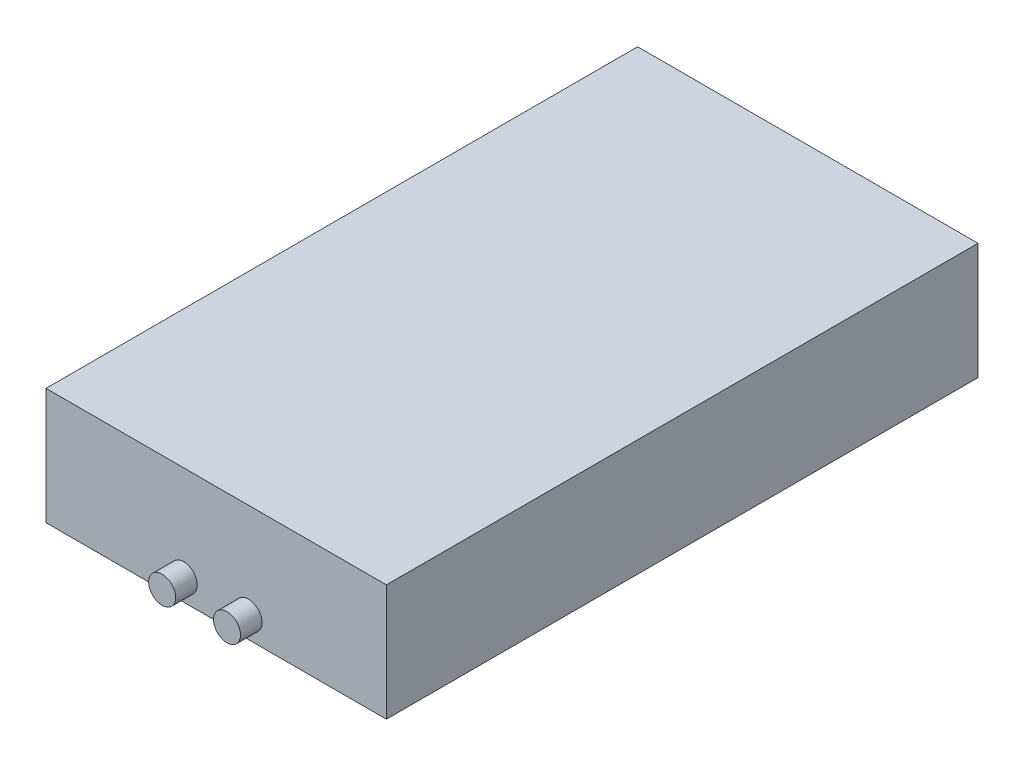
ISO-10303-21;
HEADER;
FILE_DESCRIPTION(('STEP AP214'),'2;1');
FILE_NAME('part.step','',(''),(''),'','','');
FILE_SCHEMA(('AUTOMOTIVE_DESIGN { 1 0 10303 214 1 1 1 1 }'));
ENDSEC;
DATA;
#1=APPLICATION_CONTEXT('core data for automotive mechanical design processes');
#2=APPLICATION_PROTOCOL_DEFINITION('international standard','automotive_design',2000,#1);
#3=PRODUCT_CONTEXT('',#1,'mechanical');
#4=PRODUCT('Part','Part','',(#3));
#5=PRODUCT_RELATED_PRODUCT_CATEGORY('part','',(#4));
#6=PRODUCT_DEFINITION_FORMATION('','',#4);
#7=PRODUCT_DEFINITION_CONTEXT('part definition',#1,'design');
#8=PRODUCT_DEFINITION('design','',#6,#7);
#9=PRODUCT_DEFINITION_SHAPE('','',#8);
#10=(LENGTH_UNIT() NAMED_UNIT(*) SI_UNIT(.MILLI.,.METRE.));
#11=(NAMED_UNIT(*) PLANE_ANGLE_UNIT() SI_UNIT($,.RADIAN.));
#12=(NAMED_UNIT(*) SI_UNIT($,.STERADIAN.) SOLID_ANGLE_UNIT());
#13=UNCERTAINTY_MEASURE_WITH_UNIT(LENGTH_MEASURE(1.E-05),#10,'distance_accuracy_value','');
#14=(GEOMETRIC_REPRESENTATION_CONTEXT(3) GLOBAL_UNCERTAINTY_ASSIGNED_CONTEXT((#13)) GLOBAL_UNIT_ASSIGNED_CONTEXT((#10,
#11,#12)) REPRESENTATION_CONTEXT('',''));
#15=CARTESIAN_POINT('',(0.,0.,0.));
#16=DIRECTION('',(0.,0.,1.));
#17=DIRECTION('',(1.,0.,0.));
#18=AXIS2_PLACEMENT_3D('',#15,#16,#17);
#19=CARTESIAN_POINT('',(-31.5,10.77,109.5));
#20=DIRECTION('',(1.,0.,0.));
#21=DIRECTION('',(0.,0.,-1.));
#22=AXIS2_PLACEMENT_3D('',#19,#20,#21);
#23=PLANE('',#22);
#24=DIRECTION('',(0.,-1.,0.));
#25=VECTOR('',#24,1.);
#26=CARTESIAN_POINT('',(-31.5,10.77,0.));
#27=LINE('',#26,#25);
#28=CARTESIAN_POINT('',(-31.5,10.77,0.));
#29=VERTEX_POINT('',#28);
#30=CARTESIAN_POINT('',(-31.5,-10.77,0.));
#31=VERTEX_POINT('',#30);
#32=EDGE_CURVE('E134',#29,#31,#27,.T.);
#33=ORIENTED_EDGE('',*,*,#32,.T.);
#34=DIRECTION('',(0.,0.,-1.));
#35=VECTOR('',#34,1.);
#36=CARTESIAN_POINT('',(-31.5,-10.77,109.5));
#37=LINE('',#36,#35);
#38=CARTESIAN_POINT('',(-31.5,-10.77,109.5));
#39=VERTEX_POINT('',#38);
#40=EDGE_CURVE('E11',#39,#31,#37,.T.);
#41=ORIENTED_EDGE('',*,*,#40,.F.);
#42=DIRECTION('',(0.,-1.,0.));
#43=VECTOR('',#42,1.);
#44=CARTESIAN_POINT('',(-31.5,10.77,109.5));
#45=LINE('',#44,#43);
#46=CARTESIAN_POINT('',(-31.5,10.77,109.5));
#47=VERTEX_POINT('',#46);
#48=EDGE_CURVE('E135',#47,#39,#45,.T.);
#49=ORIENTED_EDGE('',*,*,#48,.F.);
#50=DIRECTION('',(0.,0.,-1.));
#51=VECTOR('',#50,1.);
#52=CARTESIAN_POINT('',(-31.5,10.77,109.5));
#53=LINE('',#52,#51);
#54=EDGE_CURVE('E141',#47,#29,#53,.T.);
#55=ORIENTED_EDGE('',*,*,#54,.T.);
#56=EDGE_LOOP('',(#33,#41,#49,#55));
#57=FACE_BOUND('',#56,.T.);
#58=ADVANCED_FACE('F39',(#57),#23,.F.);
#59=CARTESIAN_POINT('',(-31.5,-10.77,109.5));
#60=DIRECTION('',(0.,1.,0.));
#61=DIRECTION('',(0.,0.,1.));
#62=AXIS2_PLACEMENT_3D('',#59,#60,#61);
#63=PLANE('',#62);
#64=CARTESIAN_POINT('',(-7.00000000000001,-10.77,105.2));
#65=DIRECTION('',(0.,-1.,0.));
#66=DIRECTION('',(0.,0.,-1.));
#67=AXIS2_PLACEMENT_3D('',#64,#65,#66);
#68=CIRCLE('',#67,0.799999999999999);
#69=CARTESIAN_POINT('',(-7.00000000000001,-10.77,104.4));
#70=VERTEX_POINT('',#69);
#71=EDGE_CURVE('E110',#70,#70,#68,.T.);
#72=ORIENTED_EDGE('',*,*,#71,.F.);
#73=EDGE_LOOP('',(#72));
#74=FACE_BOUND('',#73,.T.);
#75=CARTESIAN_POINT('',(6.99999999999999,-10.77,105.2));
#76=DIRECTION('',(0.,-1.,0.));
#77=DIRECTION('',(0.,0.,-1.));
#78=AXIS2_PLACEMENT_3D('',#75,#76,#77);
#79=CIRCLE('',#78,0.799999999999999);
#80=CARTESIAN_POINT('',(6.99999999999999,-10.77,104.4));
#81=VERTEX_POINT('',#80);
#82=EDGE_CURVE('E109',#81,#81,#79,.T.);
#83=ORIENTED_EDGE('',*,*,#82,.F.);
#84=EDGE_LOOP('',(#83));
#85=FACE_BOUND('',#84,.T.);
#86=CARTESIAN_POINT('',(22.3097569986762,-10.77,30.7625219081238));
#87=DIRECTION('',(0.,-1.,0.));
#88=DIRECTION('',(0.,0.,-1.));
#89=AXIS2_PLACEMENT_3D('',#86,#87,#88);
#90=CIRCLE('',#89,0.799999999999999);
#91=CARTESIAN_POINT('',(22.3097569986762,-10.77,29.9625219081238));
#92=VERTEX_POINT('',#91);
#93=EDGE_CURVE('E122',#92,#92,#90,.T.);
#94=ORIENTED_EDGE('',*,*,#93,.F.);
#95=EDGE_LOOP('',(#94));
#96=FACE_BOUND('',#95,.T.);
#97=CARTESIAN_POINT('',(-22.3097569986762,-10.77,30.7625219081238));
#98=DIRECTION('',(0.,-1.,0.));
#99=DIRECTION('',(0.,0.,-1.));
#100=AXIS2_PLACEMENT_3D('',#97,#98,#99);
#101=CIRCLE('',#100,0.799999999999999);
#102=CARTESIAN_POINT('',(-22.3097569986762,-10.77,29.9625219081238));
#103=VERTEX_POINT('',#102);
#104=EDGE_CURVE('E128',#103,#103,#101,.T.);
#105=ORIENTED_EDGE('',*,*,#104,.F.);
#106=EDGE_LOOP('',(#105));
#107=FACE_BOUND('',#106,.T.);
#108=DIRECTION('',(1.,0.,0.));
#109=VECTOR('',#108,1.);
#110=CARTESIAN_POINT('',(-31.5,-10.77,0.));
#111=LINE('',#110,#109);
#112=CARTESIAN_POINT('',(31.5,-10.77,0.));
#113=VERTEX_POINT('',#112);
#114=EDGE_CURVE('E144',#31,#113,#111,.T.);
#115=ORIENTED_EDGE('',*,*,#114,.T.);
#116=DIRECTION('',(0.,0.,-1.));
#117=VECTOR('',#116,1.);
#118=CARTESIAN_POINT('',(31.5,-10.77,109.5));
#119=LINE('',#118,#117);
#120=CARTESIAN_POINT('',(31.5,-10.77,109.5));
#121=VERTEX_POINT('',#120);
#122=EDGE_CURVE('E47',#121,#113,#119,.T.);
#123=ORIENTED_EDGE('',*,*,#122,.F.);
#124=DIRECTION('',(1.,0.,0.));
#125=VECTOR('',#124,1.);
#126=CARTESIAN_POINT('',(-31.5,-10.77,109.5));
#127=LINE('',#126,#125);
#128=EDGE_CURVE('E86',#39,#121,#127,.T.);
#129=ORIENTED_EDGE('',*,*,#128,.F.);
#130=ORIENTED_EDGE('',*,*,#40,.T.);
#131=EDGE_LOOP('',(#115,#123,#129,#130));
#132=FACE_BOUND('',#131,.T.);
#133=ADVANCED_FACE('F168',(#74,#85,#96,#107,#132),#63,.F.);
#134=CARTESIAN_POINT('',(31.5,10.77,109.5));
#135=DIRECTION('',(-1.,0.,0.));
#136=DIRECTION('',(0.,-1.,0.));
#137=AXIS2_PLACEMENT_3D('',#134,#135,#136);
#138=PLANE('',#137);
#139=DIRECTION('',(0.,1.,0.));
#140=VECTOR('',#139,1.);
#141=CARTESIAN_POINT('',(31.5,10.77,0.));
#142=LINE('',#141,#140);
#143=CARTESIAN_POINT('',(31.5,10.77,0.));
#144=VERTEX_POINT('',#143);
#145=EDGE_CURVE('E73',#113,#144,#142,.T.);
#146=ORIENTED_EDGE('',*,*,#145,.T.);
#147=DIRECTION('',(0.,0.,-1.));
#148=VECTOR('',#147,1.);
#149=CARTESIAN_POINT('',(31.5,10.77,109.5));
#150=LINE('',#149,#148);
#151=CARTESIAN_POINT('',(31.5,10.77,109.5));
#152=VERTEX_POINT('',#151);
#153=EDGE_CURVE('E149',#152,#144,#150,.T.);
#154=ORIENTED_EDGE('',*,*,#153,.F.);
#155=DIRECTION('',(0.,1.,0.));
#156=VECTOR('',#155,1.);
#157=CARTESIAN_POINT('',(31.5,10.77,109.5));
#158=LINE('',#157,#156);
#159=EDGE_CURVE('E138',#121,#152,#158,.T.);
#160=ORIENTED_EDGE('',*,*,#159,.F.);
#161=ORIENTED_EDGE('',*,*,#122,.T.);
#162=EDGE_LOOP('',(#146,#154,#160,#161));
#163=FACE_BOUND('',#162,.T.);
#164=ADVANCED_FACE('F151',(#163),#138,.F.);
#165=CARTESIAN_POINT('',(-31.5,10.77,109.5));
#166=DIRECTION('',(0.,-1.,0.));
#167=DIRECTION('',(0.,0.,-1.));
#168=AXIS2_PLACEMENT_3D('',#165,#166,#167);
#169=PLANE('',#168);
#170=DIRECTION('',(-1.,0.,0.));
#171=VECTOR('',#170,1.);
#172=CARTESIAN_POINT('',(-31.5,10.77,0.));
#173=LINE('',#172,#171);
#174=EDGE_CURVE('E79',#144,#29,#173,.T.);
#175=ORIENTED_EDGE('',*,*,#174,.T.);
#176=ORIENTED_EDGE('',*,*,#54,.F.);
#177=DIRECTION('',(-1.,0.,0.));
#178=VECTOR('',#177,1.);
#179=CARTESIAN_POINT('',(-31.5,10.77,109.5));
#180=LINE('',#179,#178);
#181=EDGE_CURVE('E55',#152,#47,#180,.T.);
#182=ORIENTED_EDGE('',*,*,#181,.F.);
#183=ORIENTED_EDGE('',*,*,#153,.T.);
#184=EDGE_LOOP('',(#175,#176,#182,#183));
#185=FACE_BOUND('',#184,.T.);
#186=ADVANCED_FACE('F158',(#185),#169,.F.);
#187=CARTESIAN_POINT('',(0.,0.,109.5));
#188=DIRECTION('',(0.,0.,1.));
#189=DIRECTION('',(1.,0.,0.));
#190=AXIS2_PLACEMENT_3D('',#187,#188,#189);
#191=PLANE('',#190);
#192=CARTESIAN_POINT('',(6.,-6.77,109.5));
#193=DIRECTION('',(0.,0.,1.));
#194=DIRECTION('',(-1.,0.,0.));
#195=AXIS2_PLACEMENT_3D('',#192,#193,#194);
#196=CIRCLE('',#195,2.5);
#197=CARTESIAN_POINT('',(3.5,-6.77,109.5));
#198=VERTEX_POINT('',#197);
#199=EDGE_CURVE('E231',#198,#198,#196,.T.);
#200=ORIENTED_EDGE('',*,*,#199,.F.);
#201=EDGE_LOOP('',(#200));
#202=FACE_BOUND('',#201,.T.);
#203=CARTESIAN_POINT('',(-6.,-6.77,109.5));
#204=DIRECTION('',(0.,0.,1.));
#205=DIRECTION('',(1.,0.,0.));
#206=AXIS2_PLACEMENT_3D('',#203,#204,#205);
#207=CIRCLE('',#206,2.5);
#208=CARTESIAN_POINT('',(-3.5,-6.77,109.5));
#209=VERTEX_POINT('',#208);
#210=EDGE_CURVE('E237',#209,#209,#207,.T.);
#211=ORIENTED_EDGE('',*,*,#210,.F.);
#212=EDGE_LOOP('',(#211));
#213=FACE_BOUND('',#212,.T.);
#214=ORIENTED_EDGE('',*,*,#48,.T.);
#215=ORIENTED_EDGE('',*,*,#128,.T.);
#216=ORIENTED_EDGE('',*,*,#159,.T.);
#217=ORIENTED_EDGE('',*,*,#181,.T.);
#218=EDGE_LOOP('',(#214,#215,#216,#217));
#219=FACE_BOUND('',#218,.T.);
#220=ADVANCED_FACE('F160',(#202,#213,#219),#191,.T.);
#221=CARTESIAN_POINT('',(0.,0.,0.));
#222=DIRECTION('',(0.,0.,1.));
#223=DIRECTION('',(1.,0.,0.));
#224=AXIS2_PLACEMENT_3D('',#221,#222,#223);
#225=PLANE('',#224);
#226=CARTESIAN_POINT('',(0.,0.,0.));
#227=DIRECTION('',(0.,0.,-1.));
#228=DIRECTION('',(-1.,0.,0.));
#229=AXIS2_PLACEMENT_3D('',#226,#227,#228);
#230=CIRCLE('',#229,7.41430232056074);
#231=CARTESIAN_POINT('',(-7.41430232056074,0.,0.));
#232=VERTEX_POINT('',#231);
#233=EDGE_CURVE('E225',#232,#232,#230,.T.);
#234=ORIENTED_EDGE('',*,*,#233,.F.);
#235=EDGE_LOOP('',(#234));
#236=FACE_BOUND('',#235,.T.);
#237=ORIENTED_EDGE('',*,*,#32,.F.);
#238=ORIENTED_EDGE('',*,*,#174,.F.);
#239=ORIENTED_EDGE('',*,*,#145,.F.);
#240=ORIENTED_EDGE('',*,*,#114,.F.);
#241=EDGE_LOOP('',(#237,#238,#239,#240));
#242=FACE_BOUND('',#241,.T.);
#243=ADVANCED_FACE('F154',(#236,#242),#225,.F.);
#244=CARTESIAN_POINT('',(-22.3097569986762,-5.57,30.7625219081238));
#245=DIRECTION('',(0.,-1.,0.));
#246=DIRECTION('',(0.,0.,-1.));
#247=AXIS2_PLACEMENT_3D('',#244,#245,#246);
#248=CONICAL_SURFACE('',#247,0.799999999999999,1.02974425867665);
#249=CARTESIAN_POINT('',(-22.3097569986762,-5.08931150477795,30.7625219081238));
#250=VERTEX_POINT('',#249);
#251=VERTEX_LOOP('',#250);
#252=FACE_BOUND('',#251,.T.);
#253=CARTESIAN_POINT('',(-22.3097569986762,-5.57,30.7625219081238));
#254=DIRECTION('',(0.,-1.,0.));
#255=DIRECTION('',(0.,0.,-1.));
#256=AXIS2_PLACEMENT_3D('',#253,#254,#255);
#257=CIRCLE('',#256,0.799999999999999);
#258=CARTESIAN_POINT('',(-22.3097569986762,-5.57,29.9625219081238));
#259=VERTEX_POINT('',#258);
#260=EDGE_CURVE('E131',#259,#259,#257,.T.);
#261=ORIENTED_EDGE('',*,*,#260,.T.);
#262=EDGE_LOOP('',(#261));
#263=FACE_BOUND('',#262,.T.);
#264=ADVANCED_FACE('F189',(#252,#263),#248,.F.);
#265=CARTESIAN_POINT('',(-22.3097569986762,-10.77,30.7625219081238));
#266=DIRECTION('',(0.,-1.,0.));
#267=DIRECTION('',(0.,0.,-1.));
#268=AXIS2_PLACEMENT_3D('',#265,#266,#267);
#269=CYLINDRICAL_SURFACE('',#268,0.799999999999999);
#270=ORIENTED_EDGE('',*,*,#260,.F.);
#271=EDGE_LOOP('',(#270));
#272=FACE_BOUND('',#271,.T.);
#273=ORIENTED_EDGE('',*,*,#104,.T.);
#274=EDGE_LOOP('',(#273));
#275=FACE_BOUND('',#274,.T.);
#276=ADVANCED_FACE('F186',(#272,#275),#269,.F.);
#277=CARTESIAN_POINT('',(22.3097569986762,-5.57,30.7625219081238));
#278=DIRECTION('',(0.,-1.,0.));
#279=DIRECTION('',(0.,0.,-1.));
#280=AXIS2_PLACEMENT_3D('',#277,#278,#279);
#281=CONICAL_SURFACE('',#280,0.799999999999999,1.02974425867665);
#282=CARTESIAN_POINT('',(22.3097569986762,-5.08931150477795,30.7625219081238));
#283=VERTEX_POINT('',#282);
#284=VERTEX_LOOP('',#283);
#285=FACE_BOUND('',#284,.T.);
#286=CARTESIAN_POINT('',(22.3097569986762,-5.57,30.7625219081238));
#287=DIRECTION('',(0.,-1.,0.));
#288=DIRECTION('',(0.,0.,-1.));
#289=AXIS2_PLACEMENT_3D('',#286,#287,#288);
#290=CIRCLE('',#289,0.799999999999999);
#291=CARTESIAN_POINT('',(22.3097569986762,-5.57,29.9625219081238));
#292=VERTEX_POINT('',#291);
#293=EDGE_CURVE('E125',#292,#292,#290,.T.);
#294=ORIENTED_EDGE('',*,*,#293,.T.);
#295=EDGE_LOOP('',(#294));
#296=FACE_BOUND('',#295,.T.);
#297=ADVANCED_FACE('F188',(#285,#296),#281,.F.);
#298=CARTESIAN_POINT('',(22.3097569986762,-10.77,30.7625219081238));
#299=DIRECTION('',(0.,-1.,0.));
#300=DIRECTION('',(0.,0.,-1.));
#301=AXIS2_PLACEMENT_3D('',#298,#299,#300);
#302=CYLINDRICAL_SURFACE('',#301,0.799999999999999);
#303=ORIENTED_EDGE('',*,*,#293,.F.);
#304=EDGE_LOOP('',(#303));
#305=FACE_BOUND('',#304,.T.);
#306=ORIENTED_EDGE('',*,*,#93,.T.);
#307=EDGE_LOOP('',(#306));
#308=FACE_BOUND('',#307,.T.);
#309=ADVANCED_FACE('F196',(#305,#308),#302,.F.);
#310=CARTESIAN_POINT('',(6.99999999999999,-5.57,105.2));
#311=DIRECTION('',(0.,-1.,0.));
#312=DIRECTION('',(0.,0.,-1.));
#313=AXIS2_PLACEMENT_3D('',#310,#311,#312);
#314=CONICAL_SURFACE('',#313,0.799999999999999,1.02974425867665);
#315=CARTESIAN_POINT('',(6.99999999999998,-5.08931150477795,105.2));
#316=VERTEX_POINT('',#315);
#317=VERTEX_LOOP('',#316);
#318=FACE_BOUND('',#317,.T.);
#319=CARTESIAN_POINT('',(6.99999999999999,-5.57,105.2));
#320=DIRECTION('',(0.,-1.,0.));
#321=DIRECTION('',(0.,0.,-1.));
#322=AXIS2_PLACEMENT_3D('',#319,#320,#321);
#323=CIRCLE('',#322,0.799999999999999);
#324=CARTESIAN_POINT('',(6.99999999999999,-5.57,104.4));
#325=VERTEX_POINT('',#324);
#326=EDGE_CURVE('E113',#325,#325,#323,.T.);
#327=ORIENTED_EDGE('',*,*,#326,.T.);
#328=EDGE_LOOP('',(#327));
#329=FACE_BOUND('',#328,.T.);
#330=ADVANCED_FACE('F263',(#318,#329),#314,.F.);
#331=CARTESIAN_POINT('',(6.99999999999999,-10.77,105.2));
#332=DIRECTION('',(0.,-1.,0.));
#333=DIRECTION('',(0.,0.,-1.));
#334=AXIS2_PLACEMENT_3D('',#331,#332,#333);
#335=CYLINDRICAL_SURFACE('',#334,0.799999999999999);
#336=ORIENTED_EDGE('',*,*,#326,.F.);
#337=EDGE_LOOP('',(#336));
#338=FACE_BOUND('',#337,.T.);
#339=ORIENTED_EDGE('',*,*,#82,.T.);
#340=EDGE_LOOP('',(#339));
#341=FACE_BOUND('',#340,.T.);
#342=ADVANCED_FACE('F103',(#338,#341),#335,.F.);
#343=CARTESIAN_POINT('',(-7.00000000000001,-5.57,105.2));
#344=DIRECTION('',(0.,-1.,0.));
#345=DIRECTION('',(0.,0.,-1.));
#346=AXIS2_PLACEMENT_3D('',#343,#344,#345);
#347=CONICAL_SURFACE('',#346,0.799999999999999,1.02974425867665);
#348=CARTESIAN_POINT('',(-7.00000000000002,-5.08931150477795,105.2));
#349=VERTEX_POINT('',#348);
#350=VERTEX_LOOP('',#349);
#351=FACE_BOUND('',#350,.T.);
#352=CARTESIAN_POINT('',(-7.00000000000001,-5.57,105.2));
#353=DIRECTION('',(0.,-1.,0.));
#354=DIRECTION('',(0.,0.,-1.));
#355=AXIS2_PLACEMENT_3D('',#352,#353,#354);
#356=CIRCLE('',#355,0.799999999999999);
#357=CARTESIAN_POINT('',(-7.00000000000001,-5.57,104.4));
#358=VERTEX_POINT('',#357);
#359=EDGE_CURVE('E107',#358,#358,#356,.T.);
#360=ORIENTED_EDGE('',*,*,#359,.T.);
#361=EDGE_LOOP('',(#360));
#362=FACE_BOUND('',#361,.T.);
#363=ADVANCED_FACE('F99',(#351,#362),#347,.F.);
#364=CARTESIAN_POINT('',(-7.00000000000001,-10.77,105.2));
#365=DIRECTION('',(0.,-1.,0.));
#366=DIRECTION('',(0.,0.,-1.));
#367=AXIS2_PLACEMENT_3D('',#364,#365,#366);
#368=CYLINDRICAL_SURFACE('',#367,0.799999999999999);
#369=ORIENTED_EDGE('',*,*,#359,.F.);
#370=EDGE_LOOP('',(#369));
#371=FACE_BOUND('',#370,.T.);
#372=ORIENTED_EDGE('',*,*,#71,.T.);
#373=EDGE_LOOP('',(#372));
#374=FACE_BOUND('',#373,.T.);
#375=ADVANCED_FACE('F102',(#371,#374),#368,.F.);
#376=CARTESIAN_POINT('',(-6.,-6.77,113.5));
#377=DIRECTION('',(0.,0.,-1.));
#378=DIRECTION('',(-1.,0.,0.));
#379=AXIS2_PLACEMENT_3D('',#376,#377,#378);
#380=CYLINDRICAL_SURFACE('',#379,2.5);
#381=CARTESIAN_POINT('',(-6.,-6.77,113.5));
#382=DIRECTION('',(0.,0.,1.));
#383=DIRECTION('',(1.,0.,0.));
#384=AXIS2_PLACEMENT_3D('',#381,#382,#383);
#385=CIRCLE('',#384,2.5);
#386=CARTESIAN_POINT('',(-3.5,-6.77,113.5));
#387=VERTEX_POINT('',#386);
#388=EDGE_CURVE('E116',#387,#387,#385,.T.);
#389=ORIENTED_EDGE('',*,*,#388,.F.);
#390=EDGE_LOOP('',(#389));
#391=FACE_BOUND('',#390,.T.);
#392=ORIENTED_EDGE('',*,*,#210,.T.);
#393=EDGE_LOOP('',(#392));
#394=FACE_BOUND('',#393,.T.);
#395=ADVANCED_FACE('F244',(#391,#394),#380,.T.);
#396=CARTESIAN_POINT('',(-6.,-6.77,113.5));
#397=DIRECTION('',(0.,0.,1.));
#398=DIRECTION('',(1.,0.,0.));
#399=AXIS2_PLACEMENT_3D('',#396,#397,#398);
#400=PLANE('',#399);
#401=ORIENTED_EDGE('',*,*,#388,.T.);
#402=EDGE_LOOP('',(#401));
#403=FACE_BOUND('',#402,.T.);
#404=ADVANCED_FACE('F247',(#403),#400,.T.);
#405=CARTESIAN_POINT('',(6.,-6.77,113.5));
#406=DIRECTION('',(0.,0.,-1.));
#407=DIRECTION('',(-1.,0.,0.));
#408=AXIS2_PLACEMENT_3D('',#405,#406,#407);
#409=CYLINDRICAL_SURFACE('',#408,2.5);
#410=CARTESIAN_POINT('',(6.,-6.77,113.5));
#411=DIRECTION('',(0.,0.,1.));
#412=DIRECTION('',(-1.,0.,0.));
#413=AXIS2_PLACEMENT_3D('',#410,#411,#412);
#414=CIRCLE('',#413,2.5);
#415=CARTESIAN_POINT('',(3.5,-6.77,113.5));
#416=VERTEX_POINT('',#415);
#417=EDGE_CURVE('E234',#416,#416,#414,.T.);
#418=ORIENTED_EDGE('',*,*,#417,.F.);
#419=EDGE_LOOP('',(#418));
#420=FACE_BOUND('',#419,.T.);
#421=ORIENTED_EDGE('',*,*,#199,.T.);
#422=EDGE_LOOP('',(#421));
#423=FACE_BOUND('',#422,.T.);
#424=ADVANCED_FACE('F254',(#420,#423),#409,.T.);
#425=CARTESIAN_POINT('',(6.,-6.77,113.5));
#426=DIRECTION('',(0.,0.,-1.));
#427=DIRECTION('',(-1.,0.,0.));
#428=AXIS2_PLACEMENT_3D('',#425,#426,#427);
#429=PLANE('',#428);
#430=ORIENTED_EDGE('',*,*,#417,.T.);
#431=EDGE_LOOP('',(#430));
#432=FACE_BOUND('',#431,.T.);
#433=ADVANCED_FACE('F347',(#432),#429,.F.);
#434=CARTESIAN_POINT('',(0.,0.,2.));
#435=DIRECTION('',(0.,0.,-1.));
#436=DIRECTION('',(-1.,0.,0.));
#437=AXIS2_PLACEMENT_3D('',#434,#435,#436);
#438=CYLINDRICAL_SURFACE('',#437,7.41430232056074);
#439=CARTESIAN_POINT('',(0.,0.,2.));
#440=DIRECTION('',(0.,0.,-1.));
#441=DIRECTION('',(-1.,0.,0.));
#442=AXIS2_PLACEMENT_3D('',#439,#440,#441);
#443=CIRCLE('',#442,7.41430232056074);
#444=CARTESIAN_POINT('',(-7.41430232056074,0.,2.));
#445=VERTEX_POINT('',#444);
#446=EDGE_CURVE('E228',#445,#445,#443,.T.);
#447=ORIENTED_EDGE('',*,*,#446,.F.);
#448=EDGE_LOOP('',(#447));
#449=FACE_BOUND('',#448,.T.);
#450=ORIENTED_EDGE('',*,*,#233,.T.);
#451=EDGE_LOOP('',(#450));
#452=FACE_BOUND('',#451,.T.);
#453=ADVANCED_FACE('F355',(#449,#452),#438,.F.);
#454=CARTESIAN_POINT('',(0.,0.,2.));
#455=DIRECTION('',(0.,0.,-1.));
#456=DIRECTION('',(-1.,0.,0.));
#457=AXIS2_PLACEMENT_3D('',#454,#455,#456);
#458=PLANE('',#457);
#459=CARTESIAN_POINT('',(0.,0.,2.));
#460=DIRECTION('',(0.,0.,-1.));
#461=DIRECTION('',(-1.,0.,0.));
#462=AXIS2_PLACEMENT_3D('',#459,#460,#461);
#463=CIRCLE('',#462,4.8814210220034);
#464=CARTESIAN_POINT('',(-4.8814210220034,0.,2.));
#465=VERTEX_POINT('',#464);
#466=EDGE_CURVE('E222',#465,#465,#463,.T.);
#467=ORIENTED_EDGE('',*,*,#466,.F.);
#468=EDGE_LOOP('',(#467));
#469=FACE_BOUND('',#468,.T.);
#470=ORIENTED_EDGE('',*,*,#446,.T.);
#471=EDGE_LOOP('',(#470));
#472=FACE_BOUND('',#471,.T.);
#473=ADVANCED_FACE('F215',(#469,#472),#458,.T.);
#474=CARTESIAN_POINT('',(0.,0.,2.));
#475=DIRECTION('',(0.,0.,-1.));
#476=DIRECTION('',(-1.,0.,0.));
#477=AXIS2_PLACEMENT_3D('',#474,#475,#476);
#478=CYLINDRICAL_SURFACE('',#477,4.8814210220034);
#479=ORIENTED_EDGE('',*,*,#466,.T.);
#480=EDGE_LOOP('',(#479));
#481=FACE_BOUND('',#480,.T.);
#482=CARTESIAN_POINT('',(0.,0.,0.));
#483=DIRECTION('',(0.,0.,-1.));
#484=DIRECTION('',(-1.,0.,0.));
#485=AXIS2_PLACEMENT_3D('',#482,#483,#484);
#486=CIRCLE('',#485,4.8814210220034);
#487=CARTESIAN_POINT('',(-4.8814210220034,0.,0.));
#488=VERTEX_POINT('',#487);
#489=EDGE_CURVE('E220',#488,#488,#486,.T.);
#490=ORIENTED_EDGE('',*,*,#489,.F.);
#491=EDGE_LOOP('',(#490));
#492=FACE_BOUND('',#491,.T.);
#493=ADVANCED_FACE('F210',(#481,#492),#478,.T.);
#494=ORIENTED_EDGE('',*,*,#489,.T.);
#495=EDGE_LOOP('',(#494));
#496=FACE_BOUND('',#495,.T.);
#497=ADVANCED_FACE('F205',(#496),#225,.F.);
#498=CLOSED_SHELL('',(#58,#133,#164,#186,#220,#243,#264,#276,#297,#309,#330,#342,#363,#375,#395,
#404,#424,#433,#453,#473,#493,#497));
#499=MANIFOLD_SOLID_BREP('B2',#498);
#500=ADVANCED_BREP_SHAPE_REPRESENTATION('',(#18,#499),#14);
#501=SHAPE_DEFINITION_REPRESENTATION(#9,#500);
ENDSEC;
END-ISO-10303-21;
